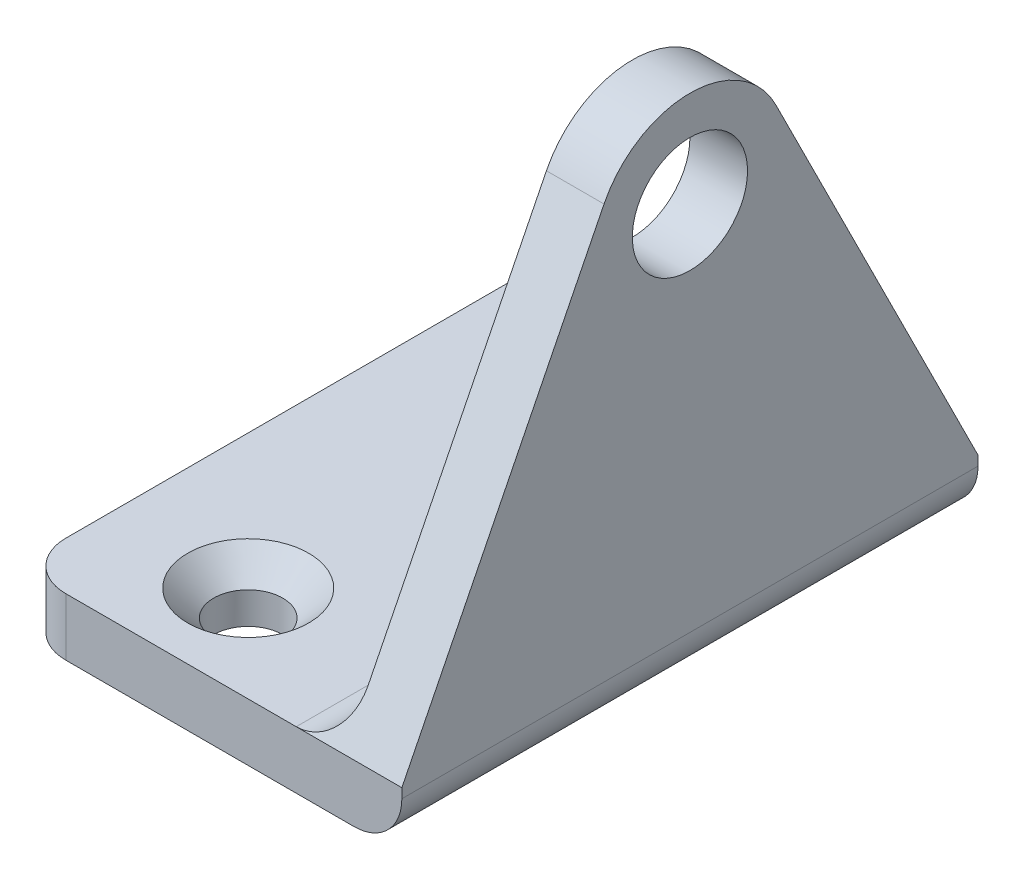
ISO-10303-21;
HEADER;
FILE_DESCRIPTION(('STEP AP214'),'2;1');
FILE_NAME('part.step','',(''),(''),'','','');
FILE_SCHEMA(('AUTOMOTIVE_DESIGN { 1 0 10303 214 1 1 1 1 }'));
ENDSEC;
DATA;
#1=APPLICATION_CONTEXT('core data for automotive mechanical design processes');
#2=APPLICATION_PROTOCOL_DEFINITION('international standard','automotive_design',2000,#1);
#3=PRODUCT_CONTEXT('',#1,'mechanical');
#4=PRODUCT('Part','Part','',(#3));
#5=PRODUCT_RELATED_PRODUCT_CATEGORY('part','',(#4));
#6=PRODUCT_DEFINITION_FORMATION('','',#4);
#7=PRODUCT_DEFINITION_CONTEXT('part definition',#1,'design');
#8=PRODUCT_DEFINITION('design','',#6,#7);
#9=PRODUCT_DEFINITION_SHAPE('','',#8);
#10=(LENGTH_UNIT() NAMED_UNIT(*) SI_UNIT(.MILLI.,.METRE.));
#11=(NAMED_UNIT(*) PLANE_ANGLE_UNIT() SI_UNIT($,.RADIAN.));
#12=(NAMED_UNIT(*) SI_UNIT($,.STERADIAN.) SOLID_ANGLE_UNIT());
#13=UNCERTAINTY_MEASURE_WITH_UNIT(LENGTH_MEASURE(1.E-05),#10,'distance_accuracy_value','');
#14=(GEOMETRIC_REPRESENTATION_CONTEXT(3) GLOBAL_UNCERTAINTY_ASSIGNED_CONTEXT((#13)) GLOBAL_UNIT_ASSIGNED_CONTEXT((#10,
#11,#12)) REPRESENTATION_CONTEXT('',''));
#15=CARTESIAN_POINT('',(0.,0.,0.));
#16=DIRECTION('',(0.,0.,1.));
#17=DIRECTION('',(1.,0.,0.));
#18=AXIS2_PLACEMENT_3D('',#15,#16,#17);
#19=CARTESIAN_POINT('',(0.,3.,0.));
#20=DIRECTION('',(0.,-1.,0.));
#21=DIRECTION('',(0.,0.,-1.));
#22=AXIS2_PLACEMENT_3D('',#19,#20,#21);
#23=PLANE('',#22);
#24=CARTESIAN_POINT('',(-3.,3.,-10.));
#25=DIRECTION('',(0.,1.,0.));
#26=DIRECTION('',(0.,0.,1.));
#27=AXIS2_PLACEMENT_3D('',#24,#25,#26);
#28=CIRCLE('',#27,3.15);
#29=CARTESIAN_POINT('',(-3.,3.,-6.85));
#30=VERTEX_POINT('',#29);
#31=EDGE_CURVE('E519',#30,#30,#28,.T.);
#32=ORIENTED_EDGE('',*,*,#31,.F.);
#33=EDGE_LOOP('',(#32));
#34=FACE_BOUND('',#33,.T.);
#35=CARTESIAN_POINT('',(-3.,3.,10.));
#36=DIRECTION('',(0.,1.,0.));
#37=DIRECTION('',(0.,0.,1.));
#38=AXIS2_PLACEMENT_3D('',#35,#36,#37);
#39=CIRCLE('',#38,3.15);
#40=CARTESIAN_POINT('',(-3.,3.,13.15));
#41=VERTEX_POINT('',#40);
#42=EDGE_CURVE('E260',#41,#41,#39,.T.);
#43=ORIENTED_EDGE('',*,*,#42,.F.);
#44=EDGE_LOOP('',(#43));
#45=FACE_BOUND('',#44,.T.);
#46=DIRECTION('',(1.,0.,0.));
#47=VECTOR('',#46,1.);
#48=CARTESIAN_POINT('',(10.,3.,15.));
#49=LINE('',#48,#47);
#50=CARTESIAN_POINT('',(-7.5,3.,15.));
#51=VERTEX_POINT('',#50);
#52=CARTESIAN_POINT('',(4.5,3.,15.));
#53=VERTEX_POINT('',#52);
#54=EDGE_CURVE('E186',#51,#53,#49,.T.);
#55=ORIENTED_EDGE('',*,*,#54,.T.);
#56=DIRECTION('',(0.,0.,1.));
#57=VECTOR('',#56,1.);
#58=CARTESIAN_POINT('',(4.5,3.,-15.));
#59=LINE('',#58,#57);
#60=CARTESIAN_POINT('',(4.5,3.,-15.));
#61=VERTEX_POINT('',#60);
#62=EDGE_CURVE('E264',#53,#61,#59,.F.);
#63=ORIENTED_EDGE('',*,*,#62,.T.);
#64=DIRECTION('',(-1.,0.,0.));
#65=VECTOR('',#64,1.);
#66=CARTESIAN_POINT('',(10.,3.,-15.));
#67=LINE('',#66,#65);
#68=CARTESIAN_POINT('',(-7.50000000000001,3.,-15.));
#69=VERTEX_POINT('',#68);
#70=EDGE_CURVE('E190',#61,#69,#67,.T.);
#71=ORIENTED_EDGE('',*,*,#70,.T.);
#72=CARTESIAN_POINT('',(-7.5,3.,-12.5));
#73=DIRECTION('',(0.,-1.,0.));
#74=DIRECTION('',(0.,0.,-1.));
#75=AXIS2_PLACEMENT_3D('',#72,#73,#74);
#76=CIRCLE('',#75,2.5);
#77=CARTESIAN_POINT('',(-10.,3.,-12.5));
#78=VERTEX_POINT('',#77);
#79=EDGE_CURVE('E249',#69,#78,#76,.F.);
#80=ORIENTED_EDGE('',*,*,#79,.T.);
#81=DIRECTION('',(0.,0.,1.));
#82=VECTOR('',#81,1.);
#83=CARTESIAN_POINT('',(-10.,3.,-15.));
#84=LINE('',#83,#82);
#85=CARTESIAN_POINT('',(-10.,3.,12.5));
#86=VERTEX_POINT('',#85);
#87=EDGE_CURVE('E182',#78,#86,#84,.T.);
#88=ORIENTED_EDGE('',*,*,#87,.T.);
#89=CARTESIAN_POINT('',(-7.5,3.,12.5));
#90=DIRECTION('',(0.,-1.,0.));
#91=DIRECTION('',(0.,0.,-1.));
#92=AXIS2_PLACEMENT_3D('',#89,#90,#91);
#93=CIRCLE('',#92,2.5);
#94=EDGE_CURVE('E246',#86,#51,#93,.F.);
#95=ORIENTED_EDGE('',*,*,#94,.T.);
#96=EDGE_LOOP('',(#55,#63,#71,#80,#88,#95));
#97=FACE_BOUND('',#96,.T.);
#98=ADVANCED_FACE('F45',(#34,#45,#97),#23,.F.);
#99=CARTESIAN_POINT('',(-10.,3.,-15.));
#100=DIRECTION('',(1.,0.,0.));
#101=DIRECTION('',(0.,0.,-1.));
#102=AXIS2_PLACEMENT_3D('',#99,#100,#101);
#103=PLANE('',#102);
#104=ORIENTED_EDGE('',*,*,#87,.F.);
#105=DIRECTION('',(0.,-1.,0.));
#106=VECTOR('',#105,1.);
#107=CARTESIAN_POINT('',(-10.,3.,-12.5));
#108=LINE('',#107,#106);
#109=CARTESIAN_POINT('',(-10.,0.,-12.5));
#110=VERTEX_POINT('',#109);
#111=EDGE_CURVE('E242',#78,#110,#108,.T.);
#112=ORIENTED_EDGE('',*,*,#111,.T.);
#113=DIRECTION('',(0.,0.,1.));
#114=VECTOR('',#113,1.);
#115=CARTESIAN_POINT('',(-10.,0.,-15.));
#116=LINE('',#115,#114);
#117=CARTESIAN_POINT('',(-10.,0.,12.5));
#118=VERTEX_POINT('',#117);
#119=EDGE_CURVE('E179',#110,#118,#116,.T.);
#120=ORIENTED_EDGE('',*,*,#119,.T.);
#121=DIRECTION('',(0.,-1.,0.));
#122=VECTOR('',#121,1.);
#123=CARTESIAN_POINT('',(-10.,3.,12.5));
#124=LINE('',#123,#122);
#125=EDGE_CURVE('E239',#118,#86,#124,.F.);
#126=ORIENTED_EDGE('',*,*,#125,.T.);
#127=EDGE_LOOP('',(#104,#112,#120,#126));
#128=FACE_BOUND('',#127,.T.);
#129=ADVANCED_FACE('F286',(#128),#103,.F.);
#130=CARTESIAN_POINT('',(10.,3.,15.));
#131=DIRECTION('',(0.,0.,-1.));
#132=DIRECTION('',(-1.,0.,0.));
#133=AXIS2_PLACEMENT_3D('',#130,#131,#132);
#134=PLANE('',#133);
#135=DIRECTION('',(1.,0.,0.));
#136=VECTOR('',#135,1.);
#137=CARTESIAN_POINT('',(10.,0.,15.));
#138=LINE('',#137,#136);
#139=CARTESIAN_POINT('',(-7.5,0.,15.));
#140=VERTEX_POINT('',#139);
#141=CARTESIAN_POINT('',(7.5,0.,15.));
#142=VERTEX_POINT('',#141);
#143=EDGE_CURVE('E198',#140,#142,#138,.T.);
#144=ORIENTED_EDGE('',*,*,#143,.T.);
#145=CARTESIAN_POINT('',(7.5,2.5,15.));
#146=DIRECTION('',(0.,0.,-1.));
#147=DIRECTION('',(-1.,0.,0.));
#148=AXIS2_PLACEMENT_3D('',#145,#146,#147);
#149=CIRCLE('',#148,2.5);
#150=CARTESIAN_POINT('',(10.,2.5,15.));
#151=VERTEX_POINT('',#150);
#152=EDGE_CURVE('E236',#142,#151,#149,.F.);
#153=ORIENTED_EDGE('',*,*,#152,.T.);
#154=DIRECTION('',(0.,-1.,0.));
#155=VECTOR('',#154,1.);
#156=CARTESIAN_POINT('',(10.,3.,15.));
#157=LINE('',#156,#155);
#158=CARTESIAN_POINT('',(10.,3.,15.));
#159=VERTEX_POINT('',#158);
#160=EDGE_CURVE('E208',#159,#151,#157,.T.);
#161=ORIENTED_EDGE('',*,*,#160,.F.);
#162=DIRECTION('',(1.,0.,0.));
#163=VECTOR('',#162,1.);
#164=CARTESIAN_POINT('',(7.,3.,15.));
#165=LINE('',#164,#163);
#166=EDGE_CURVE('E61',#53,#159,#165,.T.);
#167=ORIENTED_EDGE('',*,*,#166,.F.);
#168=ORIENTED_EDGE('',*,*,#54,.F.);
#169=DIRECTION('',(0.,-1.,0.));
#170=VECTOR('',#169,1.);
#171=CARTESIAN_POINT('',(-7.5,3.,15.));
#172=LINE('',#171,#170);
#173=EDGE_CURVE('E232',#51,#140,#172,.T.);
#174=ORIENTED_EDGE('',*,*,#173,.T.);
#175=EDGE_LOOP('',(#144,#153,#161,#167,#168,#174));
#176=FACE_BOUND('',#175,.T.);
#177=ADVANCED_FACE('F292',(#176),#134,.F.);
#178=CARTESIAN_POINT('',(10.,3.,-15.));
#179=DIRECTION('',(-1.,0.,0.));
#180=DIRECTION('',(0.,0.,1.));
#181=AXIS2_PLACEMENT_3D('',#178,#179,#180);
#182=PLANE('',#181);
#183=ORIENTED_EDGE('',*,*,#160,.T.);
#184=DIRECTION('',(0.,0.,-1.));
#185=VECTOR('',#184,1.);
#186=CARTESIAN_POINT('',(10.,2.5,-15.));
#187=LINE('',#186,#185);
#188=CARTESIAN_POINT('',(10.,2.5,-15.));
#189=VERTEX_POINT('',#188);
#190=EDGE_CURVE('E212',#151,#189,#187,.T.);
#191=ORIENTED_EDGE('',*,*,#190,.T.);
#192=DIRECTION('',(0.,-1.,0.));
#193=VECTOR('',#192,1.);
#194=CARTESIAN_POINT('',(10.,3.,-15.));
#195=LINE('',#194,#193);
#196=CARTESIAN_POINT('',(10.,3.,-15.));
#197=VERTEX_POINT('',#196);
#198=EDGE_CURVE('E194',#197,#189,#195,.T.);
#199=ORIENTED_EDGE('',*,*,#198,.F.);
#200=DIRECTION('',(0.,-0.894427190999916,-0.447213595499958));
#201=VECTOR('',#200,1.);
#202=CARTESIAN_POINT('',(10.,6.6,-13.2));
#203=LINE('',#202,#201);
#204=CARTESIAN_POINT('',(10.,24.0557280900008,-4.47213595499961));
#205=VERTEX_POINT('',#204);
#206=EDGE_CURVE('E158',#205,#197,#203,.T.);
#207=ORIENTED_EDGE('',*,*,#206,.F.);
#208=CARTESIAN_POINT('',(10.,21.8196601125011,0.));
#209=DIRECTION('',(1.,0.,0.));
#210=DIRECTION('',(0.,0.,-1.));
#211=AXIS2_PLACEMENT_3D('',#208,#209,#210);
#212=CIRCLE('',#211,5.);
#213=CARTESIAN_POINT('',(10.,24.0557280900008,4.47213595499962));
#214=VERTEX_POINT('',#213);
#215=EDGE_CURVE('E168',#214,#205,#212,.F.);
#216=ORIENTED_EDGE('',*,*,#215,.F.);
#217=DIRECTION('',(0.,0.894427190999916,-0.447213595499958));
#218=VECTOR('',#217,1.);
#219=CARTESIAN_POINT('',(10.,6.6,13.2));
#220=LINE('',#219,#218);
#221=EDGE_CURVE('E144',#159,#214,#220,.T.);
#222=ORIENTED_EDGE('',*,*,#221,.F.);
#223=EDGE_LOOP('',(#183,#191,#199,#207,#216,#222));
#224=FACE_BOUND('',#223,.T.);
#225=CARTESIAN_POINT('',(10.,21.8196601125011,0.));
#226=DIRECTION('',(1.,0.,0.));
#227=DIRECTION('',(0.,0.,-1.));
#228=AXIS2_PLACEMENT_3D('',#225,#226,#227);
#229=CIRCLE('',#228,3.);
#230=CARTESIAN_POINT('',(10.,21.8196601125011,-3.));
#231=VERTEX_POINT('',#230);
#232=EDGE_CURVE('E164',#231,#231,#229,.T.);
#233=ORIENTED_EDGE('',*,*,#232,.F.);
#234=EDGE_LOOP('',(#233));
#235=FACE_BOUND('',#234,.T.);
#236=ADVANCED_FACE('F302',(#224,#235),#182,.F.);
#237=CARTESIAN_POINT('',(10.,3.,-15.));
#238=DIRECTION('',(0.,0.,1.));
#239=DIRECTION('',(1.,0.,0.));
#240=AXIS2_PLACEMENT_3D('',#237,#238,#239);
#241=PLANE('',#240);
#242=ORIENTED_EDGE('',*,*,#198,.T.);
#243=CARTESIAN_POINT('',(7.5,2.5,-15.));
#244=DIRECTION('',(0.,0.,1.));
#245=DIRECTION('',(1.,0.,0.));
#246=AXIS2_PLACEMENT_3D('',#243,#244,#245);
#247=CIRCLE('',#246,2.5);
#248=CARTESIAN_POINT('',(7.5,0.,-15.));
#249=VERTEX_POINT('',#248);
#250=EDGE_CURVE('E220',#189,#249,#247,.F.);
#251=ORIENTED_EDGE('',*,*,#250,.T.);
#252=DIRECTION('',(-1.,0.,0.));
#253=VECTOR('',#252,1.);
#254=CARTESIAN_POINT('',(10.,0.,-15.));
#255=LINE('',#254,#253);
#256=CARTESIAN_POINT('',(-7.50000000000001,0.,-15.));
#257=VERTEX_POINT('',#256);
#258=EDGE_CURVE('E187',#249,#257,#255,.T.);
#259=ORIENTED_EDGE('',*,*,#258,.T.);
#260=DIRECTION('',(0.,-1.,0.));
#261=VECTOR('',#260,1.);
#262=CARTESIAN_POINT('',(-7.50000000000001,3.,-15.));
#263=LINE('',#262,#261);
#264=EDGE_CURVE('E216',#257,#69,#263,.F.);
#265=ORIENTED_EDGE('',*,*,#264,.T.);
#266=ORIENTED_EDGE('',*,*,#70,.F.);
#267=EDGE_CURVE('E191',#197,#61,#67,.T.);
#268=ORIENTED_EDGE('',*,*,#267,.F.);
#269=EDGE_LOOP('',(#242,#251,#259,#265,#266,#268));
#270=FACE_BOUND('',#269,.T.);
#271=ADVANCED_FACE('F275',(#270),#241,.F.);
#272=CARTESIAN_POINT('',(0.,0.,0.));
#273=DIRECTION('',(0.,-1.,0.));
#274=DIRECTION('',(0.,0.,-1.));
#275=AXIS2_PLACEMENT_3D('',#272,#273,#274);
#276=PLANE('',#275);
#277=CARTESIAN_POINT('',(-3.,0.,-10.));
#278=DIRECTION('',(0.,-1.,0.));
#279=DIRECTION('',(0.,0.,-1.));
#280=AXIS2_PLACEMENT_3D('',#277,#278,#279);
#281=CIRCLE('',#280,1.8);
#282=CARTESIAN_POINT('',(-3.,0.,-11.8));
#283=VERTEX_POINT('',#282);
#284=EDGE_CURVE('E256',#283,#283,#281,.T.);
#285=ORIENTED_EDGE('',*,*,#284,.F.);
#286=EDGE_LOOP('',(#285));
#287=FACE_BOUND('',#286,.T.);
#288=CARTESIAN_POINT('',(-3.,0.,10.));
#289=DIRECTION('',(0.,-1.,0.));
#290=DIRECTION('',(0.,0.,-1.));
#291=AXIS2_PLACEMENT_3D('',#288,#289,#290);
#292=CIRCLE('',#291,1.8);
#293=CARTESIAN_POINT('',(-3.,0.,8.2));
#294=VERTEX_POINT('',#293);
#295=EDGE_CURVE('E169',#294,#294,#292,.T.);
#296=ORIENTED_EDGE('',*,*,#295,.F.);
#297=EDGE_LOOP('',(#296));
#298=FACE_BOUND('',#297,.T.);
#299=ORIENTED_EDGE('',*,*,#258,.F.);
#300=DIRECTION('',(0.,0.,-1.));
#301=VECTOR('',#300,1.);
#302=CARTESIAN_POINT('',(7.5,0.,15.));
#303=LINE('',#302,#301);
#304=EDGE_CURVE('E229',#249,#142,#303,.F.);
#305=ORIENTED_EDGE('',*,*,#304,.T.);
#306=ORIENTED_EDGE('',*,*,#143,.F.);
#307=CARTESIAN_POINT('',(-7.5,0.,12.5));
#308=DIRECTION('',(0.,-1.,0.));
#309=DIRECTION('',(0.,0.,-1.));
#310=AXIS2_PLACEMENT_3D('',#307,#308,#309);
#311=CIRCLE('',#310,2.5);
#312=EDGE_CURVE('E223',#140,#118,#311,.T.);
#313=ORIENTED_EDGE('',*,*,#312,.T.);
#314=ORIENTED_EDGE('',*,*,#119,.F.);
#315=CARTESIAN_POINT('',(-7.5,0.,-12.5));
#316=DIRECTION('',(0.,-1.,0.));
#317=DIRECTION('',(0.,0.,-1.));
#318=AXIS2_PLACEMENT_3D('',#315,#316,#317);
#319=CIRCLE('',#318,2.5);
#320=EDGE_CURVE('E226',#110,#257,#319,.T.);
#321=ORIENTED_EDGE('',*,*,#320,.T.);
#322=EDGE_LOOP('',(#299,#305,#306,#313,#314,#321));
#323=FACE_BOUND('',#322,.T.);
#324=ADVANCED_FACE('F296',(#287,#298,#323),#276,.T.);
#325=CARTESIAN_POINT('',(7.,21.8196601125011,0.));
#326=DIRECTION('',(1.,0.,0.));
#327=DIRECTION('',(0.,0.,-1.));
#328=AXIS2_PLACEMENT_3D('',#325,#326,#327);
#329=CYLINDRICAL_SURFACE('',#328,5.);
#330=ORIENTED_EDGE('',*,*,#215,.T.);
#331=DIRECTION('',(1.,0.,0.));
#332=VECTOR('',#331,1.);
#333=CARTESIAN_POINT('',(7.,24.0557280900008,-4.47213595499961));
#334=LINE('',#333,#332);
#335=CARTESIAN_POINT('',(7.,24.0557280900008,-4.47213595499961));
#336=VERTEX_POINT('',#335);
#337=EDGE_CURVE('E152',#336,#205,#334,.T.);
#338=ORIENTED_EDGE('',*,*,#337,.F.);
#339=CARTESIAN_POINT('',(7.,21.8196601125011,0.));
#340=DIRECTION('',(1.,0.,0.));
#341=DIRECTION('',(0.,0.,-1.));
#342=AXIS2_PLACEMENT_3D('',#339,#340,#341);
#343=CIRCLE('',#342,5.);
#344=CARTESIAN_POINT('',(7.,24.0557280900008,4.47213595499962));
#345=VERTEX_POINT('',#344);
#346=EDGE_CURVE('E131',#345,#336,#343,.F.);
#347=ORIENTED_EDGE('',*,*,#346,.F.);
#348=DIRECTION('',(1.,0.,0.));
#349=VECTOR('',#348,1.);
#350=CARTESIAN_POINT('',(7.,24.0557280900008,4.47213595499962));
#351=LINE('',#350,#349);
#352=EDGE_CURVE('E141',#345,#214,#351,.T.);
#353=ORIENTED_EDGE('',*,*,#352,.T.);
#354=EDGE_LOOP('',(#330,#338,#347,#353));
#355=FACE_BOUND('',#354,.T.);
#356=ADVANCED_FACE('F150',(#355),#329,.T.);
#357=CARTESIAN_POINT('',(7.,6.6,-13.2));
#358=DIRECTION('',(0.,-0.447213595499958,0.894427190999916));
#359=DIRECTION('',(0.,-0.894427190999916,-0.447213595499958));
#360=AXIS2_PLACEMENT_3D('',#357,#358,#359);
#361=PLANE('',#360);
#362=ORIENTED_EDGE('',*,*,#206,.T.);
#363=ORIENTED_EDGE('',*,*,#267,.T.);
#364=CARTESIAN_POINT('',(4.5,5.5,-13.75));
#365=DIRECTION('',(0.,-0.447213595499958,0.894427190999916));
#366=DIRECTION('',(0.,-0.894427190999916,-0.447213595499958));
#367=AXIS2_PLACEMENT_3D('',#364,#365,#366);
#368=ELLIPSE('',#367,2.79508497187474,2.5);
#369=CARTESIAN_POINT('',(7.,5.5,-13.75));
#370=VERTEX_POINT('',#369);
#371=EDGE_CURVE('E11',#61,#370,#368,.T.);
#372=ORIENTED_EDGE('',*,*,#371,.T.);
#373=DIRECTION('',(0.,-0.894427190999916,-0.447213595499958));
#374=VECTOR('',#373,1.);
#375=CARTESIAN_POINT('',(7.,6.6,-13.2));
#376=LINE('',#375,#374);
#377=EDGE_CURVE('E138',#336,#370,#376,.T.);
#378=ORIENTED_EDGE('',*,*,#377,.F.);
#379=ORIENTED_EDGE('',*,*,#337,.T.);
#380=EDGE_LOOP('',(#362,#363,#372,#378,#379));
#381=FACE_BOUND('',#380,.T.);
#382=ADVANCED_FACE('F305',(#381),#361,.F.);
#383=CARTESIAN_POINT('',(7.,21.8196601125011,0.));
#384=DIRECTION('',(1.,0.,0.));
#385=DIRECTION('',(0.,0.,-1.));
#386=AXIS2_PLACEMENT_3D('',#383,#384,#385);
#387=CYLINDRICAL_SURFACE('',#386,3.);
#388=CARTESIAN_POINT('',(7.,21.8196601125011,0.));
#389=DIRECTION('',(1.,0.,0.));
#390=DIRECTION('',(0.,0.,-1.));
#391=AXIS2_PLACEMENT_3D('',#388,#389,#390);
#392=CIRCLE('',#391,3.);
#393=CARTESIAN_POINT('',(7.,21.8196601125011,-3.));
#394=VERTEX_POINT('',#393);
#395=EDGE_CURVE('E154',#394,#394,#392,.T.);
#396=ORIENTED_EDGE('',*,*,#395,.F.);
#397=EDGE_LOOP('',(#396));
#398=FACE_BOUND('',#397,.T.);
#399=ORIENTED_EDGE('',*,*,#232,.T.);
#400=EDGE_LOOP('',(#399));
#401=FACE_BOUND('',#400,.T.);
#402=ADVANCED_FACE('F307',(#398,#401),#387,.F.);
#403=CARTESIAN_POINT('',(7.,6.6,13.2));
#404=DIRECTION('',(0.,-0.447213595499958,-0.894427190999916));
#405=DIRECTION('',(0.,0.894427190999916,-0.447213595499958));
#406=AXIS2_PLACEMENT_3D('',#403,#404,#405);
#407=PLANE('',#406);
#408=ORIENTED_EDGE('',*,*,#221,.T.);
#409=ORIENTED_EDGE('',*,*,#352,.F.);
#410=DIRECTION('',(0.,0.894427190999916,-0.447213595499958));
#411=VECTOR('',#410,1.);
#412=CARTESIAN_POINT('',(7.,6.6,13.2));
#413=LINE('',#412,#411);
#414=CARTESIAN_POINT('',(7.,5.5,13.75));
#415=VERTEX_POINT('',#414);
#416=EDGE_CURVE('E126',#415,#345,#413,.T.);
#417=ORIENTED_EDGE('',*,*,#416,.F.);
#418=CARTESIAN_POINT('',(4.5,5.5,13.75));
#419=DIRECTION('',(0.,-0.447213595499958,-0.894427190999916));
#420=DIRECTION('',(0.,0.894427190999916,-0.447213595499958));
#421=AXIS2_PLACEMENT_3D('',#418,#419,#420);
#422=ELLIPSE('',#421,2.79508497187474,2.5);
#423=EDGE_CURVE('E55',#415,#53,#422,.T.);
#424=ORIENTED_EDGE('',*,*,#423,.T.);
#425=ORIENTED_EDGE('',*,*,#166,.T.);
#426=EDGE_LOOP('',(#408,#409,#417,#424,#425));
#427=FACE_BOUND('',#426,.T.);
#428=ADVANCED_FACE('F142',(#427),#407,.F.);
#429=CARTESIAN_POINT('',(7.,0.,0.));
#430=DIRECTION('',(1.,0.,0.));
#431=DIRECTION('',(0.,0.,-1.));
#432=AXIS2_PLACEMENT_3D('',#429,#430,#431);
#433=PLANE('',#432);
#434=ORIENTED_EDGE('',*,*,#395,.T.);
#435=EDGE_LOOP('',(#434));
#436=FACE_BOUND('',#435,.T.);
#437=ORIENTED_EDGE('',*,*,#377,.T.);
#438=DIRECTION('',(0.,0.,1.));
#439=VECTOR('',#438,1.);
#440=CARTESIAN_POINT('',(7.,5.5,15.));
#441=LINE('',#440,#439);
#442=EDGE_CURVE('E134',#370,#415,#441,.T.);
#443=ORIENTED_EDGE('',*,*,#442,.T.);
#444=ORIENTED_EDGE('',*,*,#416,.T.);
#445=ORIENTED_EDGE('',*,*,#346,.T.);
#446=EDGE_LOOP('',(#437,#443,#444,#445));
#447=FACE_BOUND('',#446,.T.);
#448=ADVANCED_FACE('F129',(#436,#447),#433,.F.);
#449=CARTESIAN_POINT('',(7.5,2.5,-15.));
#450=DIRECTION('',(0.,0.,1.));
#451=DIRECTION('',(1.,0.,0.));
#452=AXIS2_PLACEMENT_3D('',#449,#450,#451);
#453=CYLINDRICAL_SURFACE('',#452,2.5);
#454=ORIENTED_EDGE('',*,*,#152,.F.);
#455=ORIENTED_EDGE('',*,*,#304,.F.);
#456=ORIENTED_EDGE('',*,*,#250,.F.);
#457=ORIENTED_EDGE('',*,*,#190,.F.);
#458=EDGE_LOOP('',(#454,#455,#456,#457));
#459=FACE_BOUND('',#458,.T.);
#460=ADVANCED_FACE('F299',(#459),#453,.T.);
#461=CARTESIAN_POINT('',(-7.5,3.,-12.5));
#462=DIRECTION('',(0.,-1.,0.));
#463=DIRECTION('',(0.,0.,-1.));
#464=AXIS2_PLACEMENT_3D('',#461,#462,#463);
#465=CYLINDRICAL_SURFACE('',#464,2.5);
#466=ORIENTED_EDGE('',*,*,#79,.F.);
#467=ORIENTED_EDGE('',*,*,#264,.F.);
#468=ORIENTED_EDGE('',*,*,#320,.F.);
#469=ORIENTED_EDGE('',*,*,#111,.F.);
#470=EDGE_LOOP('',(#466,#467,#468,#469));
#471=FACE_BOUND('',#470,.T.);
#472=ADVANCED_FACE('F282',(#471),#465,.T.);
#473=CARTESIAN_POINT('',(-7.5,3.,12.5));
#474=DIRECTION('',(0.,-1.,0.));
#475=DIRECTION('',(0.,0.,-1.));
#476=AXIS2_PLACEMENT_3D('',#473,#474,#475);
#477=CYLINDRICAL_SURFACE('',#476,2.5);
#478=ORIENTED_EDGE('',*,*,#94,.F.);
#479=ORIENTED_EDGE('',*,*,#125,.F.);
#480=ORIENTED_EDGE('',*,*,#312,.F.);
#481=ORIENTED_EDGE('',*,*,#173,.F.);
#482=EDGE_LOOP('',(#478,#479,#480,#481));
#483=FACE_BOUND('',#482,.T.);
#484=ADVANCED_FACE('F290',(#483),#477,.T.);
#485=CARTESIAN_POINT('',(-3.,3.,10.));
#486=DIRECTION('',(0.,1.,0.));
#487=DIRECTION('',(0.,0.,1.));
#488=AXIS2_PLACEMENT_3D('',#485,#486,#487);
#489=CYLINDRICAL_SURFACE('',#488,1.8);
#490=ORIENTED_EDGE('',*,*,#295,.T.);
#491=EDGE_LOOP('',(#490));
#492=FACE_BOUND('',#491,.T.);
#493=CARTESIAN_POINT('',(-3.,1.65,10.));
#494=DIRECTION('',(0.,1.,0.));
#495=DIRECTION('',(0.,0.,1.));
#496=AXIS2_PLACEMENT_3D('',#493,#494,#495);
#497=CIRCLE('',#496,1.8);
#498=CARTESIAN_POINT('',(-3.,1.65,11.8));
#499=VERTEX_POINT('',#498);
#500=EDGE_CURVE('E255',#499,#499,#497,.T.);
#501=ORIENTED_EDGE('',*,*,#500,.T.);
#502=EDGE_LOOP('',(#501));
#503=FACE_BOUND('',#502,.T.);
#504=ADVANCED_FACE('F341',(#492,#503),#489,.F.);
#505=CARTESIAN_POINT('',(-3.,3.,10.));
#506=DIRECTION('',(0.,1.,0.));
#507=DIRECTION('',(0.,0.,1.));
#508=AXIS2_PLACEMENT_3D('',#505,#506,#507);
#509=CONICAL_SURFACE('',#508,3.15,0.785398163397448);
#510=ORIENTED_EDGE('',*,*,#500,.F.);
#511=EDGE_LOOP('',(#510));
#512=FACE_BOUND('',#511,.T.);
#513=ORIENTED_EDGE('',*,*,#42,.T.);
#514=EDGE_LOOP('',(#513));
#515=FACE_BOUND('',#514,.T.);
#516=ADVANCED_FACE('F345',(#512,#515),#509,.F.);
#517=CARTESIAN_POINT('',(-3.,3.,-10.));
#518=DIRECTION('',(0.,1.,0.));
#519=DIRECTION('',(0.,0.,1.));
#520=AXIS2_PLACEMENT_3D('',#517,#518,#519);
#521=CYLINDRICAL_SURFACE('',#520,1.8);
#522=ORIENTED_EDGE('',*,*,#284,.T.);
#523=EDGE_LOOP('',(#522));
#524=FACE_BOUND('',#523,.T.);
#525=CARTESIAN_POINT('',(-3.,1.65,-10.));
#526=DIRECTION('',(0.,1.,0.));
#527=DIRECTION('',(0.,0.,1.));
#528=AXIS2_PLACEMENT_3D('',#525,#526,#527);
#529=CIRCLE('',#528,1.8);
#530=CARTESIAN_POINT('',(-3.,1.65,-8.2));
#531=VERTEX_POINT('',#530);
#532=EDGE_CURVE('E261',#531,#531,#529,.T.);
#533=ORIENTED_EDGE('',*,*,#532,.T.);
#534=EDGE_LOOP('',(#533));
#535=FACE_BOUND('',#534,.T.);
#536=ADVANCED_FACE('F351',(#524,#535),#521,.F.);
#537=CARTESIAN_POINT('',(-3.,3.,-10.));
#538=DIRECTION('',(0.,1.,0.));
#539=DIRECTION('',(0.,0.,1.));
#540=AXIS2_PLACEMENT_3D('',#537,#538,#539);
#541=CONICAL_SURFACE('',#540,3.15,0.785398163397448);
#542=ORIENTED_EDGE('',*,*,#532,.F.);
#543=EDGE_LOOP('',(#542));
#544=FACE_BOUND('',#543,.T.);
#545=ORIENTED_EDGE('',*,*,#31,.T.);
#546=EDGE_LOOP('',(#545));
#547=FACE_BOUND('',#546,.T.);
#548=ADVANCED_FACE('F440',(#544,#547),#541,.F.);
#549=CARTESIAN_POINT('',(4.5,5.5,0.));
#550=DIRECTION('',(0.,0.,-1.));
#551=DIRECTION('',(-1.,0.,0.));
#552=AXIS2_PLACEMENT_3D('',#549,#550,#551);
#553=CYLINDRICAL_SURFACE('',#552,2.5);
#554=ORIENTED_EDGE('',*,*,#371,.F.);
#555=ORIENTED_EDGE('',*,*,#62,.F.);
#556=ORIENTED_EDGE('',*,*,#423,.F.);
#557=ORIENTED_EDGE('',*,*,#442,.F.);
#558=EDGE_LOOP('',(#554,#555,#556,#557));
#559=FACE_BOUND('',#558,.T.);
#560=ADVANCED_FACE('F47',(#559),#553,.F.);
#561=CLOSED_SHELL('',(#98,#129,#177,#236,#271,#324,#356,#382,#402,#428,#448,#460,#472,#484,#504,
#516,#536,#548,#560));
#562=MANIFOLD_SOLID_BREP('B2',#561);
#563=ADVANCED_BREP_SHAPE_REPRESENTATION('',(#18,#562),#14);
#564=SHAPE_DEFINITION_REPRESENTATION(#9,#563);
ENDSEC;
END-ISO-10303-21;
